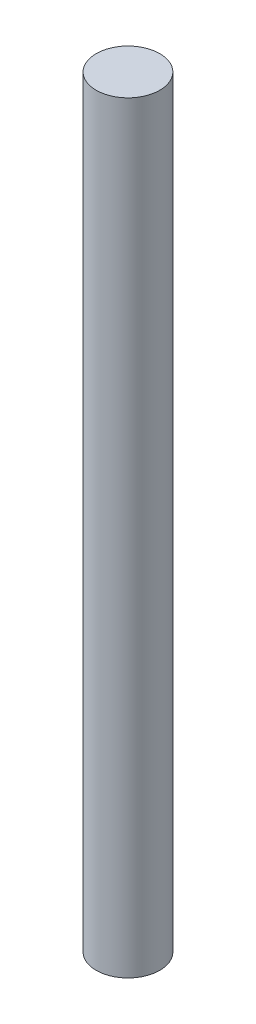
ISO-10303-21;
HEADER;
FILE_DESCRIPTION(('STEP AP214'),'2;1');
FILE_NAME('part.step','',(''),(''),'','','');
FILE_SCHEMA(('AUTOMOTIVE_DESIGN { 1 0 10303 214 1 1 1 1 }'));
ENDSEC;
DATA;
#1=APPLICATION_CONTEXT('core data for automotive mechanical design processes');
#2=APPLICATION_PROTOCOL_DEFINITION('international standard','automotive_design',2000,#1);
#3=PRODUCT_CONTEXT('',#1,'mechanical');
#4=PRODUCT('Part','Part','',(#3));
#5=PRODUCT_RELATED_PRODUCT_CATEGORY('part','',(#4));
#6=PRODUCT_DEFINITION_FORMATION('','',#4);
#7=PRODUCT_DEFINITION_CONTEXT('part definition',#1,'design');
#8=PRODUCT_DEFINITION('design','',#6,#7);
#9=PRODUCT_DEFINITION_SHAPE('','',#8);
#10=(LENGTH_UNIT() NAMED_UNIT(*) SI_UNIT(.MILLI.,.METRE.));
#11=(NAMED_UNIT(*) PLANE_ANGLE_UNIT() SI_UNIT($,.RADIAN.));
#12=(NAMED_UNIT(*) SI_UNIT($,.STERADIAN.) SOLID_ANGLE_UNIT());
#13=UNCERTAINTY_MEASURE_WITH_UNIT(LENGTH_MEASURE(1.E-05),#10,'distance_accuracy_value','');
#14=(GEOMETRIC_REPRESENTATION_CONTEXT(3) GLOBAL_UNCERTAINTY_ASSIGNED_CONTEXT((#13)) GLOBAL_UNIT_ASSIGNED_CONTEXT((#10,
#11,#12)) REPRESENTATION_CONTEXT('',''));
#15=CARTESIAN_POINT('',(0.,0.,0.));
#16=DIRECTION('',(0.,0.,1.));
#17=DIRECTION('',(1.,0.,0.));
#18=AXIS2_PLACEMENT_3D('',#15,#16,#17);
#19=CARTESIAN_POINT('',(0.,120.,0.));
#20=DIRECTION('',(0.,-1.,0.));
#21=DIRECTION('',(0.,0.,-1.));
#22=AXIS2_PLACEMENT_3D('',#19,#20,#21);
#23=CYLINDRICAL_SURFACE('',#22,5.);
#24=CARTESIAN_POINT('',(0.,120.,0.));
#25=DIRECTION('',(0.,1.,0.));
#26=DIRECTION('',(0.,0.,1.));
#27=AXIS2_PLACEMENT_3D('',#24,#25,#26);
#28=CIRCLE('',#27,5.);
#29=CARTESIAN_POINT('',(0.,120.,5.));
#30=VERTEX_POINT('',#29);
#31=EDGE_CURVE('E10',#30,#30,#28,.T.);
#32=ORIENTED_EDGE('',*,*,#31,.F.);
#33=EDGE_LOOP('',(#32));
#34=FACE_BOUND('',#33,.T.);
#35=CARTESIAN_POINT('',(0.,0.,0.));
#36=DIRECTION('',(0.,1.,0.));
#37=DIRECTION('',(0.,0.,1.));
#38=AXIS2_PLACEMENT_3D('',#35,#36,#37);
#39=CIRCLE('',#38,5.);
#40=CARTESIAN_POINT('',(0.,0.,5.));
#41=VERTEX_POINT('',#40);
#42=EDGE_CURVE('E37',#41,#41,#39,.T.);
#43=ORIENTED_EDGE('',*,*,#42,.T.);
#44=EDGE_LOOP('',(#43));
#45=FACE_BOUND('',#44,.T.);
#46=ADVANCED_FACE('F34',(#34,#45),#23,.T.);
#47=CARTESIAN_POINT('',(0.,120.,0.));
#48=DIRECTION('',(0.,1.,0.));
#49=DIRECTION('',(0.,0.,1.));
#50=AXIS2_PLACEMENT_3D('',#47,#48,#49);
#51=PLANE('',#50);
#52=ORIENTED_EDGE('',*,*,#31,.T.);
#53=EDGE_LOOP('',(#52));
#54=FACE_BOUND('',#53,.T.);
#55=ADVANCED_FACE('F49',(#54),#51,.T.);
#56=CARTESIAN_POINT('',(0.,0.,0.));
#57=DIRECTION('',(0.,1.,0.));
#58=DIRECTION('',(0.,0.,1.));
#59=AXIS2_PLACEMENT_3D('',#56,#57,#58);
#60=PLANE('',#59);
#61=ORIENTED_EDGE('',*,*,#42,.F.);
#62=EDGE_LOOP('',(#61));
#63=FACE_BOUND('',#62,.T.);
#64=ADVANCED_FACE('F47',(#63),#60,.F.);
#65=CLOSED_SHELL('',(#46,#55,#64));
#66=MANIFOLD_SOLID_BREP('B2',#65);
#67=ADVANCED_BREP_SHAPE_REPRESENTATION('',(#18,#66),#14);
#68=SHAPE_DEFINITION_REPRESENTATION(#9,#67);
ENDSEC;
END-ISO-10303-21;
